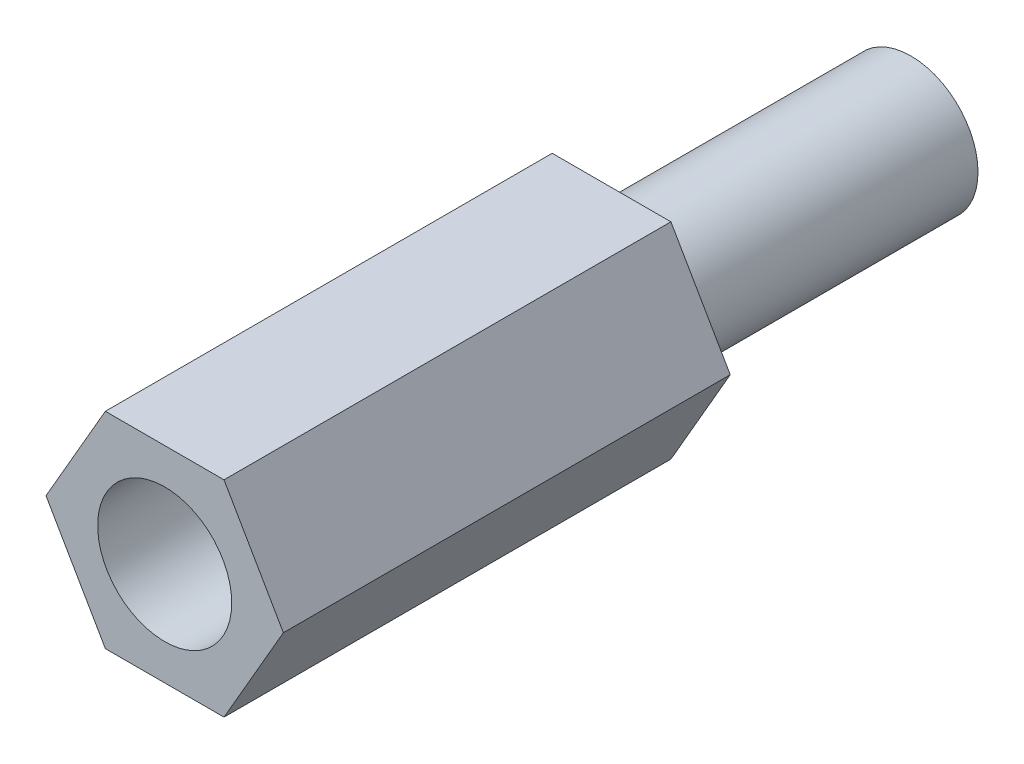
ISO-10303-21;
HEADER;
FILE_DESCRIPTION(('STEP AP214'),'2;1');
FILE_NAME('part.step','',(''),(''),'','','');
FILE_SCHEMA(('AUTOMOTIVE_DESIGN { 1 0 10303 214 1 1 1 1 }'));
ENDSEC;
DATA;
#1=APPLICATION_CONTEXT('core data for automotive mechanical design processes');
#2=APPLICATION_PROTOCOL_DEFINITION('international standard','automotive_design',2000,#1);
#3=PRODUCT_CONTEXT('',#1,'mechanical');
#4=PRODUCT('Part','Part','',(#3));
#5=PRODUCT_RELATED_PRODUCT_CATEGORY('part','',(#4));
#6=PRODUCT_DEFINITION_FORMATION('','',#4);
#7=PRODUCT_DEFINITION_CONTEXT('part definition',#1,'design');
#8=PRODUCT_DEFINITION('design','',#6,#7);
#9=PRODUCT_DEFINITION_SHAPE('','',#8);
#10=(LENGTH_UNIT() NAMED_UNIT(*) SI_UNIT(.MILLI.,.METRE.));
#11=(NAMED_UNIT(*) PLANE_ANGLE_UNIT() SI_UNIT($,.RADIAN.));
#12=(NAMED_UNIT(*) SI_UNIT($,.STERADIAN.) SOLID_ANGLE_UNIT());
#13=UNCERTAINTY_MEASURE_WITH_UNIT(LENGTH_MEASURE(1.E-05),#10,'distance_accuracy_value','');
#14=(GEOMETRIC_REPRESENTATION_CONTEXT(3) GLOBAL_UNCERTAINTY_ASSIGNED_CONTEXT((#13)) GLOBAL_UNIT_ASSIGNED_CONTEXT((#10,
#11,#12)) REPRESENTATION_CONTEXT('',''));
#15=CARTESIAN_POINT('',(0.,0.,0.));
#16=DIRECTION('',(0.,0.,1.));
#17=DIRECTION('',(1.,0.,0.));
#18=AXIS2_PLACEMENT_3D('',#15,#16,#17);
#19=CARTESIAN_POINT('',(2.65581123827227,0.,0.));
#20=DIRECTION('',(0.,0.,1.));
#21=DIRECTION('',(1.,0.,0.));
#22=AXIS2_PLACEMENT_3D('',#19,#20,#21);
#23=PLANE('',#22);
#24=DIRECTION('',(0.499999999999998,0.86602540378444,0.));
#25=VECTOR('',#24,1.);
#26=CARTESIAN_POINT('',(1.32790561913613,-2.30000000000001,0.));
#27=LINE('',#26,#25);
#28=CARTESIAN_POINT('',(1.32790561913613,-2.30000000000001,0.));
#29=VERTEX_POINT('',#28);
#30=CARTESIAN_POINT('',(2.65581123827227,0.,0.));
#31=VERTEX_POINT('',#30);
#32=EDGE_CURVE('E117',#29,#31,#27,.T.);
#33=ORIENTED_EDGE('',*,*,#32,.F.);
#34=DIRECTION('',(1.,0.,0.));
#35=VECTOR('',#34,1.);
#36=CARTESIAN_POINT('',(-1.3279056191361,-2.30000000000001,0.));
#37=LINE('',#36,#35);
#38=CARTESIAN_POINT('',(-1.3279056191361,-2.30000000000001,0.));
#39=VERTEX_POINT('',#38);
#40=EDGE_CURVE('E77',#39,#29,#37,.T.);
#41=ORIENTED_EDGE('',*,*,#40,.F.);
#42=DIRECTION('',(0.500000000000001,-0.866025403784438,0.));
#43=VECTOR('',#42,1.);
#44=CARTESIAN_POINT('',(-2.65581123827225,0.,0.));
#45=LINE('',#44,#43);
#46=CARTESIAN_POINT('',(-2.65581123827225,0.,0.));
#47=VERTEX_POINT('',#46);
#48=EDGE_CURVE('E71',#47,#39,#45,.T.);
#49=ORIENTED_EDGE('',*,*,#48,.F.);
#50=DIRECTION('',(-0.499999999999999,-0.86602540378444,0.));
#51=VECTOR('',#50,1.);
#52=CARTESIAN_POINT('',(-1.32790561913612,2.3,0.));
#53=LINE('',#52,#51);
#54=CARTESIAN_POINT('',(-1.32790561913612,2.3,0.));
#55=VERTEX_POINT('',#54);
#56=EDGE_CURVE('E107',#55,#47,#53,.T.);
#57=ORIENTED_EDGE('',*,*,#56,.F.);
#58=DIRECTION('',(-1.,0.,0.));
#59=VECTOR('',#58,1.);
#60=CARTESIAN_POINT('',(1.32790561913614,2.3,0.));
#61=LINE('',#60,#59);
#62=CARTESIAN_POINT('',(1.32790561913614,2.3,0.));
#63=VERTEX_POINT('',#62);
#64=EDGE_CURVE('E123',#63,#55,#61,.T.);
#65=ORIENTED_EDGE('',*,*,#64,.F.);
#66=DIRECTION('',(-0.5,0.866025403784439,0.));
#67=VECTOR('',#66,1.);
#68=CARTESIAN_POINT('',(2.65581123827227,0.,0.));
#69=LINE('',#68,#67);
#70=EDGE_CURVE('E120',#31,#63,#69,.T.);
#71=ORIENTED_EDGE('',*,*,#70,.F.);
#72=EDGE_LOOP('',(#33,#41,#49,#57,#65,#71));
#73=FACE_BOUND('',#72,.T.);
#74=CARTESIAN_POINT('',(0.,0.,0.));
#75=DIRECTION('',(0.,0.,1.));
#76=DIRECTION('',(1.,0.,0.));
#77=AXIS2_PLACEMENT_3D('',#74,#75,#76);
#78=CIRCLE('',#77,1.5);
#79=CARTESIAN_POINT('',(1.5,0.,0.));
#80=VERTEX_POINT('',#79);
#81=EDGE_CURVE('E11',#80,#80,#78,.F.);
#82=ORIENTED_EDGE('',*,*,#81,.F.);
#83=EDGE_LOOP('',(#82));
#84=FACE_BOUND('',#83,.T.);
#85=ADVANCED_FACE('F31',(#73,#84),#23,.F.);
#86=CARTESIAN_POINT('',(1.32790561913613,-2.30000000000001,10.));
#87=DIRECTION('',(-0.86602540378444,0.499999999999998,0.));
#88=DIRECTION('',(-0.499999999999998,-0.86602540378444,0.));
#89=AXIS2_PLACEMENT_3D('',#86,#87,#88);
#90=PLANE('',#89);
#91=ORIENTED_EDGE('',*,*,#32,.T.);
#92=DIRECTION('',(0.,0.,-1.));
#93=VECTOR('',#92,1.);
#94=CARTESIAN_POINT('',(2.65581123827227,0.,10.));
#95=LINE('',#94,#93);
#96=CARTESIAN_POINT('',(2.65581123827227,0.,10.));
#97=VERTEX_POINT('',#96);
#98=EDGE_CURVE('E40',#97,#31,#95,.T.);
#99=ORIENTED_EDGE('',*,*,#98,.F.);
#100=DIRECTION('',(0.499999999999998,0.86602540378444,0.));
#101=VECTOR('',#100,1.);
#102=CARTESIAN_POINT('',(1.32790561913613,-2.30000000000001,10.));
#103=LINE('',#102,#101);
#104=CARTESIAN_POINT('',(1.32790561913613,-2.30000000000001,10.));
#105=VERTEX_POINT('',#104);
#106=EDGE_CURVE('E128',#105,#97,#103,.T.);
#107=ORIENTED_EDGE('',*,*,#106,.F.);
#108=DIRECTION('',(0.,0.,-1.));
#109=VECTOR('',#108,1.);
#110=CARTESIAN_POINT('',(1.32790561913613,-2.30000000000001,10.));
#111=LINE('',#110,#109);
#112=EDGE_CURVE('E113',#105,#29,#111,.T.);
#113=ORIENTED_EDGE('',*,*,#112,.T.);
#114=EDGE_LOOP('',(#91,#99,#107,#113));
#115=FACE_BOUND('',#114,.T.);
#116=ADVANCED_FACE('F33',(#115),#90,.F.);
#117=CARTESIAN_POINT('',(2.65581123827227,0.,10.));
#118=DIRECTION('',(-0.866025403784439,-0.5,0.));
#119=DIRECTION('',(0.5,-0.866025403784439,0.));
#120=AXIS2_PLACEMENT_3D('',#117,#118,#119);
#121=PLANE('',#120);
#122=ORIENTED_EDGE('',*,*,#70,.T.);
#123=DIRECTION('',(0.,0.,-1.));
#124=VECTOR('',#123,1.);
#125=CARTESIAN_POINT('',(1.32790561913614,2.3,10.));
#126=LINE('',#125,#124);
#127=CARTESIAN_POINT('',(1.32790561913614,2.3,10.));
#128=VERTEX_POINT('',#127);
#129=EDGE_CURVE('E132',#128,#63,#126,.T.);
#130=ORIENTED_EDGE('',*,*,#129,.F.);
#131=DIRECTION('',(-0.5,0.866025403784439,0.));
#132=VECTOR('',#131,1.);
#133=CARTESIAN_POINT('',(2.65581123827227,0.,10.));
#134=LINE('',#133,#132);
#135=EDGE_CURVE('E86',#97,#128,#134,.T.);
#136=ORIENTED_EDGE('',*,*,#135,.F.);
#137=ORIENTED_EDGE('',*,*,#98,.T.);
#138=EDGE_LOOP('',(#122,#130,#136,#137));
#139=FACE_BOUND('',#138,.T.);
#140=ADVANCED_FACE('F135',(#139),#121,.F.);
#141=CARTESIAN_POINT('',(1.32790561913614,2.3,10.));
#142=DIRECTION('',(0.,-1.,0.));
#143=DIRECTION('',(1.,0.,0.));
#144=AXIS2_PLACEMENT_3D('',#141,#142,#143);
#145=PLANE('',#144);
#146=ORIENTED_EDGE('',*,*,#64,.T.);
#147=DIRECTION('',(0.,0.,-1.));
#148=VECTOR('',#147,1.);
#149=CARTESIAN_POINT('',(-1.32790561913612,2.3,10.));
#150=LINE('',#149,#148);
#151=CARTESIAN_POINT('',(-1.32790561913612,2.3,10.));
#152=VERTEX_POINT('',#151);
#153=EDGE_CURVE('E108',#152,#55,#150,.T.);
#154=ORIENTED_EDGE('',*,*,#153,.F.);
#155=DIRECTION('',(-1.,0.,0.));
#156=VECTOR('',#155,1.);
#157=CARTESIAN_POINT('',(1.32790561913614,2.3,10.));
#158=LINE('',#157,#156);
#159=EDGE_CURVE('E99',#128,#152,#158,.T.);
#160=ORIENTED_EDGE('',*,*,#159,.F.);
#161=ORIENTED_EDGE('',*,*,#129,.T.);
#162=EDGE_LOOP('',(#146,#154,#160,#161));
#163=FACE_BOUND('',#162,.T.);
#164=ADVANCED_FACE('F143',(#163),#145,.F.);
#165=CARTESIAN_POINT('',(-1.32790561913612,2.3,10.));
#166=DIRECTION('',(0.86602540378444,-0.499999999999998,0.));
#167=DIRECTION('',(0.499999999999998,0.86602540378444,0.));
#168=AXIS2_PLACEMENT_3D('',#165,#166,#167);
#169=PLANE('',#168);
#170=ORIENTED_EDGE('',*,*,#56,.T.);
#171=DIRECTION('',(0.,0.,-1.));
#172=VECTOR('',#171,1.);
#173=CARTESIAN_POINT('',(-2.65581123827225,0.,10.));
#174=LINE('',#173,#172);
#175=CARTESIAN_POINT('',(-2.65581123827225,0.,10.));
#176=VERTEX_POINT('',#175);
#177=EDGE_CURVE('E104',#176,#47,#174,.T.);
#178=ORIENTED_EDGE('',*,*,#177,.F.);
#179=DIRECTION('',(-0.499999999999999,-0.86602540378444,0.));
#180=VECTOR('',#179,1.);
#181=CARTESIAN_POINT('',(-1.32790561913612,2.3,10.));
#182=LINE('',#181,#180);
#183=EDGE_CURVE('E93',#152,#176,#182,.T.);
#184=ORIENTED_EDGE('',*,*,#183,.F.);
#185=ORIENTED_EDGE('',*,*,#153,.T.);
#186=EDGE_LOOP('',(#170,#178,#184,#185));
#187=FACE_BOUND('',#186,.T.);
#188=ADVANCED_FACE('F105',(#187),#169,.F.);
#189=CARTESIAN_POINT('',(-2.65581123827225,0.,10.));
#190=DIRECTION('',(0.866025403784438,0.500000000000001,0.));
#191=DIRECTION('',(-0.500000000000001,0.866025403784438,0.));
#192=AXIS2_PLACEMENT_3D('',#189,#190,#191);
#193=PLANE('',#192);
#194=ORIENTED_EDGE('',*,*,#48,.T.);
#195=DIRECTION('',(0.,0.,-1.));
#196=VECTOR('',#195,1.);
#197=CARTESIAN_POINT('',(-1.3279056191361,-2.30000000000001,10.));
#198=LINE('',#197,#196);
#199=CARTESIAN_POINT('',(-1.3279056191361,-2.30000000000001,10.));
#200=VERTEX_POINT('',#199);
#201=EDGE_CURVE('E109',#200,#39,#198,.T.);
#202=ORIENTED_EDGE('',*,*,#201,.F.);
#203=DIRECTION('',(0.500000000000001,-0.866025403784438,0.));
#204=VECTOR('',#203,1.);
#205=CARTESIAN_POINT('',(-2.65581123827225,0.,10.));
#206=LINE('',#205,#204);
#207=EDGE_CURVE('E97',#176,#200,#206,.T.);
#208=ORIENTED_EDGE('',*,*,#207,.F.);
#209=ORIENTED_EDGE('',*,*,#177,.T.);
#210=EDGE_LOOP('',(#194,#202,#208,#209));
#211=FACE_BOUND('',#210,.T.);
#212=ADVANCED_FACE('F111',(#211),#193,.F.);
#213=CARTESIAN_POINT('',(-1.3279056191361,-2.30000000000001,10.));
#214=DIRECTION('',(0.,1.,0.));
#215=DIRECTION('',(0.,0.,1.));
#216=AXIS2_PLACEMENT_3D('',#213,#214,#215);
#217=PLANE('',#216);
#218=ORIENTED_EDGE('',*,*,#40,.T.);
#219=ORIENTED_EDGE('',*,*,#112,.F.);
#220=DIRECTION('',(1.,0.,0.));
#221=VECTOR('',#220,1.);
#222=CARTESIAN_POINT('',(-1.3279056191361,-2.30000000000001,10.));
#223=LINE('',#222,#221);
#224=EDGE_CURVE('E48',#200,#105,#223,.T.);
#225=ORIENTED_EDGE('',*,*,#224,.F.);
#226=ORIENTED_EDGE('',*,*,#201,.T.);
#227=EDGE_LOOP('',(#218,#219,#225,#226));
#228=FACE_BOUND('',#227,.T.);
#229=ADVANCED_FACE('F167',(#228),#217,.F.);
#230=CARTESIAN_POINT('',(2.65581123827227,0.,10.));
#231=DIRECTION('',(0.,0.,1.));
#232=DIRECTION('',(1.,0.,0.));
#233=AXIS2_PLACEMENT_3D('',#230,#231,#232);
#234=PLANE('',#233);
#235=CARTESIAN_POINT('',(0.,0.,10.));
#236=DIRECTION('',(0.,0.,1.));
#237=DIRECTION('',(1.,0.,0.));
#238=AXIS2_PLACEMENT_3D('',#235,#236,#237);
#239=CIRCLE('',#238,1.5);
#240=CARTESIAN_POINT('',(1.5,0.,10.));
#241=VERTEX_POINT('',#240);
#242=EDGE_CURVE('E150',#241,#241,#239,.T.);
#243=ORIENTED_EDGE('',*,*,#242,.F.);
#244=EDGE_LOOP('',(#243));
#245=FACE_BOUND('',#244,.T.);
#246=ORIENTED_EDGE('',*,*,#106,.T.);
#247=ORIENTED_EDGE('',*,*,#135,.T.);
#248=ORIENTED_EDGE('',*,*,#159,.T.);
#249=ORIENTED_EDGE('',*,*,#183,.T.);
#250=ORIENTED_EDGE('',*,*,#207,.T.);
#251=ORIENTED_EDGE('',*,*,#224,.T.);
#252=EDGE_LOOP('',(#246,#247,#248,#249,#250,#251));
#253=FACE_BOUND('',#252,.T.);
#254=ADVANCED_FACE('F95',(#245,#253),#234,.T.);
#255=CARTESIAN_POINT('',(0.,0.,-6.7));
#256=DIRECTION('',(0.,0.,1.));
#257=DIRECTION('',(1.,0.,0.));
#258=AXIS2_PLACEMENT_3D('',#255,#256,#257);
#259=CYLINDRICAL_SURFACE('',#258,1.5);
#260=CARTESIAN_POINT('',(0.,0.,-6.7));
#261=DIRECTION('',(0.,0.,-1.));
#262=DIRECTION('',(-1.,0.,0.));
#263=AXIS2_PLACEMENT_3D('',#260,#261,#262);
#264=CIRCLE('',#263,1.5);
#265=CARTESIAN_POINT('',(-1.5,0.,-6.7));
#266=VERTEX_POINT('',#265);
#267=EDGE_CURVE('E121',#266,#266,#264,.T.);
#268=ORIENTED_EDGE('',*,*,#267,.F.);
#269=EDGE_LOOP('',(#268));
#270=FACE_BOUND('',#269,.T.);
#271=ORIENTED_EDGE('',*,*,#81,.T.);
#272=EDGE_LOOP('',(#271));
#273=FACE_BOUND('',#272,.T.);
#274=ADVANCED_FACE('F166',(#270,#273),#259,.T.);
#275=CARTESIAN_POINT('',(0.,0.,-6.7));
#276=DIRECTION('',(0.,0.,-1.));
#277=DIRECTION('',(-1.,0.,0.));
#278=AXIS2_PLACEMENT_3D('',#275,#276,#277);
#279=PLANE('',#278);
#280=ORIENTED_EDGE('',*,*,#267,.T.);
#281=EDGE_LOOP('',(#280));
#282=FACE_BOUND('',#281,.T.);
#283=ADVANCED_FACE('F161',(#282),#279,.T.);
#284=CARTESIAN_POINT('',(0.,0.,3.));
#285=DIRECTION('',(0.,0.,1.));
#286=DIRECTION('',(1.,0.,0.));
#287=AXIS2_PLACEMENT_3D('',#284,#285,#286);
#288=CYLINDRICAL_SURFACE('',#287,1.5);
#289=CARTESIAN_POINT('',(0.,0.,3.));
#290=DIRECTION('',(0.,0.,1.));
#291=DIRECTION('',(1.,0.,0.));
#292=AXIS2_PLACEMENT_3D('',#289,#290,#291);
#293=CIRCLE('',#292,1.5);
#294=CARTESIAN_POINT('',(1.5,0.,3.));
#295=VERTEX_POINT('',#294);
#296=EDGE_CURVE('E149',#295,#295,#293,.T.);
#297=ORIENTED_EDGE('',*,*,#296,.F.);
#298=EDGE_LOOP('',(#297));
#299=FACE_BOUND('',#298,.T.);
#300=ORIENTED_EDGE('',*,*,#242,.T.);
#301=EDGE_LOOP('',(#300));
#302=FACE_BOUND('',#301,.T.);
#303=ADVANCED_FACE('F158',(#299,#302),#288,.F.);
#304=CARTESIAN_POINT('',(0.,0.,3.));
#305=DIRECTION('',(0.,0.,1.));
#306=DIRECTION('',(1.,0.,0.));
#307=AXIS2_PLACEMENT_3D('',#304,#305,#306);
#308=PLANE('',#307);
#309=ORIENTED_EDGE('',*,*,#296,.T.);
#310=EDGE_LOOP('',(#309));
#311=FACE_BOUND('',#310,.T.);
#312=ADVANCED_FACE('F156',(#311),#308,.T.);
#313=CLOSED_SHELL('',(#85,#116,#140,#164,#188,#212,#229,#254,#274,#283,#303,#312));
#314=MANIFOLD_SOLID_BREP('B2',#313);
#315=ADVANCED_BREP_SHAPE_REPRESENTATION('',(#18,#314),#14);
#316=SHAPE_DEFINITION_REPRESENTATION(#9,#315);
ENDSEC;
END-ISO-10303-21;
